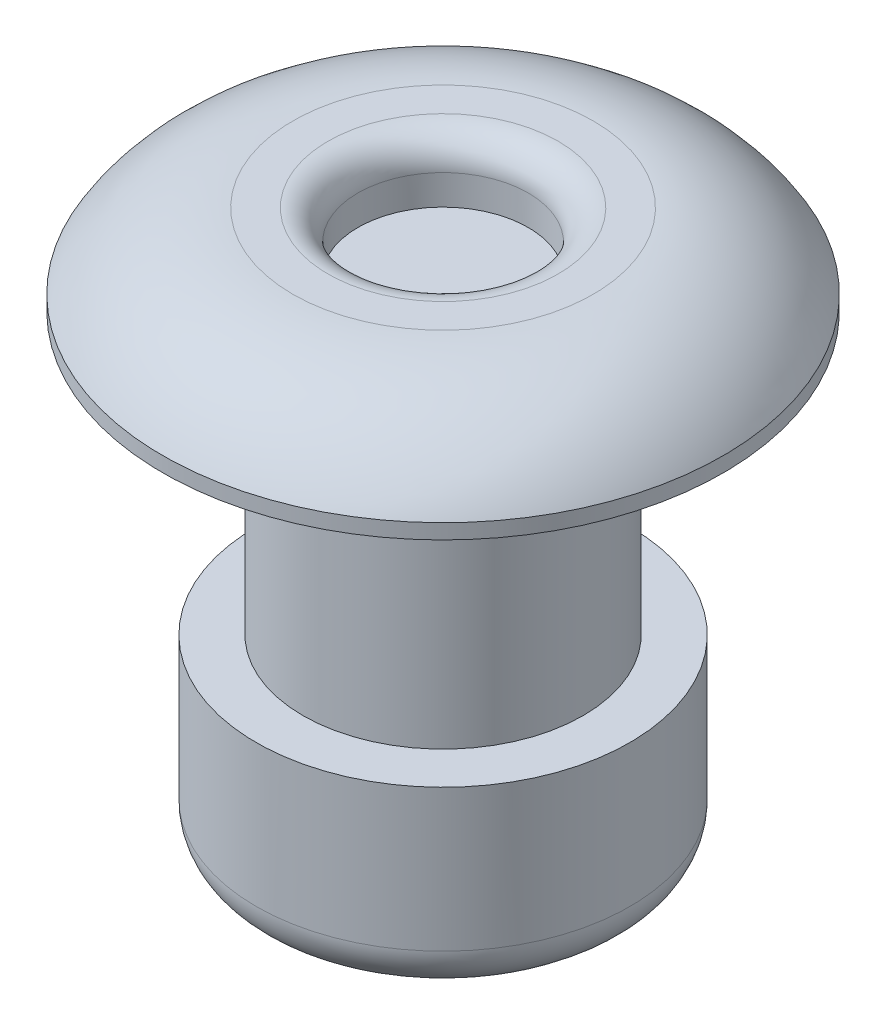
ISO-10303-21;
HEADER;
FILE_DESCRIPTION(('STEP AP214'),'2;1');
FILE_NAME('part.step','',(''),(''),'','','');
FILE_SCHEMA(('AUTOMOTIVE_DESIGN { 1 0 10303 214 1 1 1 1 }'));
ENDSEC;
DATA;
#1=APPLICATION_CONTEXT('core data for automotive mechanical design processes');
#2=APPLICATION_PROTOCOL_DEFINITION('international standard','automotive_design',2000,#1);
#3=PRODUCT_CONTEXT('',#1,'mechanical');
#4=PRODUCT('Part','Part','',(#3));
#5=PRODUCT_RELATED_PRODUCT_CATEGORY('part','',(#4));
#6=PRODUCT_DEFINITION_FORMATION('','',#4);
#7=PRODUCT_DEFINITION_CONTEXT('part definition',#1,'design');
#8=PRODUCT_DEFINITION('design','',#6,#7);
#9=PRODUCT_DEFINITION_SHAPE('','',#8);
#10=(LENGTH_UNIT() NAMED_UNIT(*) SI_UNIT(.MILLI.,.METRE.));
#11=(NAMED_UNIT(*) PLANE_ANGLE_UNIT() SI_UNIT($,.RADIAN.));
#12=(NAMED_UNIT(*) SI_UNIT($,.STERADIAN.) SOLID_ANGLE_UNIT());
#13=UNCERTAINTY_MEASURE_WITH_UNIT(LENGTH_MEASURE(1.E-05),#10,'distance_accuracy_value','');
#14=(GEOMETRIC_REPRESENTATION_CONTEXT(3) GLOBAL_UNCERTAINTY_ASSIGNED_CONTEXT((#13)) GLOBAL_UNIT_ASSIGNED_CONTEXT((#10,
#11,#12)) REPRESENTATION_CONTEXT('',''));
#15=CARTESIAN_POINT('',(0.,0.,0.));
#16=DIRECTION('',(0.,0.,1.));
#17=DIRECTION('',(1.,0.,0.));
#18=AXIS2_PLACEMENT_3D('',#15,#16,#17);
#19=CARTESIAN_POINT('',(0.,1.524,0.));
#20=DIRECTION('',(0.,-1.,0.));
#21=DIRECTION('',(0.,0.,-1.));
#22=AXIS2_PLACEMENT_3D('',#19,#20,#21);
#23=PLANE('',#22);
#24=CARTESIAN_POINT('',(0.,1.524,0.));
#25=DIRECTION('',(0.,-1.,0.));
#26=DIRECTION('',(0.,0.,-1.));
#27=AXIS2_PLACEMENT_3D('',#24,#25,#26);
#28=CIRCLE('',#27,1.9558);
#29=CARTESIAN_POINT('',(0.,1.524,-1.9558));
#30=VERTEX_POINT('',#29);
#31=EDGE_CURVE('E52',#30,#30,#28,.T.);
#32=ORIENTED_EDGE('',*,*,#31,.T.);
#33=EDGE_LOOP('',(#32));
#34=FACE_BOUND('',#33,.T.);
#35=CARTESIAN_POINT('',(0.,1.524,0.));
#36=DIRECTION('',(0.,-1.,0.));
#37=DIRECTION('',(0.,0.,-1.));
#38=AXIS2_PLACEMENT_3D('',#35,#36,#37);
#39=CIRCLE('',#38,2.5527);
#40=CARTESIAN_POINT('',(0.,1.524,-2.5527));
#41=VERTEX_POINT('',#40);
#42=EDGE_CURVE('E60',#41,#41,#39,.T.);
#43=ORIENTED_EDGE('',*,*,#42,.F.);
#44=EDGE_LOOP('',(#43));
#45=FACE_BOUND('',#44,.T.);
#46=ADVANCED_FACE('F37',(#34,#45),#23,.F.);
#47=CARTESIAN_POINT('',(0.,-1.033526,0.));
#48=DIRECTION('',(0.,-1.,0.));
#49=DIRECTION('',(0.,0.,-1.));
#50=AXIS2_PLACEMENT_3D('',#47,#48,#49);
#51=DEGENERATE_TOROIDAL_SURFACE('',#50,2.5527,2.557526,.T.);
#52=CARTESIAN_POINT('',(0.,0.253999999999999,0.));
#53=DIRECTION('',(0.,-1.,0.));
#54=DIRECTION('',(0.,0.,-1.));
#55=AXIS2_PLACEMENT_3D('',#52,#53,#54);
#56=CIRCLE('',#55,4.7625);
#57=CARTESIAN_POINT('',(0.,0.253999999999999,-4.7625));
#58=VERTEX_POINT('',#57);
#59=EDGE_CURVE('E63',#58,#58,#56,.T.);
#60=ORIENTED_EDGE('',*,*,#59,.F.);
#61=EDGE_LOOP('',(#60));
#62=FACE_BOUND('',#61,.T.);
#63=ORIENTED_EDGE('',*,*,#42,.T.);
#64=EDGE_LOOP('',(#63));
#65=FACE_BOUND('',#64,.T.);
#66=ADVANCED_FACE('F103',(#62,#65),#51,.T.);
#67=CARTESIAN_POINT('',(0.,-4.15541832528664,0.));
#68=DIRECTION('',(0.,-1.,0.));
#69=DIRECTION('',(0.,0.,-1.));
#70=AXIS2_PLACEMENT_3D('',#67,#68,#69);
#71=CYLINDRICAL_SURFACE('',#70,4.7625);
#72=CARTESIAN_POINT('',(0.,0.,0.));
#73=DIRECTION('',(0.,-1.,0.));
#74=DIRECTION('',(0.,0.,-1.));
#75=AXIS2_PLACEMENT_3D('',#72,#73,#74);
#76=CIRCLE('',#75,4.7625);
#77=CARTESIAN_POINT('',(0.,0.,-4.7625));
#78=VERTEX_POINT('',#77);
#79=EDGE_CURVE('E66',#78,#78,#76,.T.);
#80=ORIENTED_EDGE('',*,*,#79,.F.);
#81=EDGE_LOOP('',(#80));
#82=FACE_BOUND('',#81,.T.);
#83=ORIENTED_EDGE('',*,*,#59,.T.);
#84=EDGE_LOOP('',(#83));
#85=FACE_BOUND('',#84,.T.);
#86=ADVANCED_FACE('F109',(#82,#85),#71,.T.);
#87=CARTESIAN_POINT('',(0.,0.,0.));
#88=DIRECTION('',(0.,1.,0.));
#89=DIRECTION('',(0.,0.,1.));
#90=AXIS2_PLACEMENT_3D('',#87,#88,#89);
#91=PLANE('',#90);
#92=CARTESIAN_POINT('',(0.,0.,0.));
#93=DIRECTION('',(0.,-1.,0.));
#94=DIRECTION('',(0.,0.,-1.));
#95=AXIS2_PLACEMENT_3D('',#92,#93,#94);
#96=CIRCLE('',#95,2.38125);
#97=CARTESIAN_POINT('',(0.,0.,-2.38125));
#98=VERTEX_POINT('',#97);
#99=EDGE_CURVE('E48',#98,#98,#96,.T.);
#100=ORIENTED_EDGE('',*,*,#99,.F.);
#101=EDGE_LOOP('',(#100));
#102=FACE_BOUND('',#101,.T.);
#103=ORIENTED_EDGE('',*,*,#79,.T.);
#104=EDGE_LOOP('',(#103));
#105=FACE_BOUND('',#104,.T.);
#106=ADVANCED_FACE('F134',(#102,#105),#91,.F.);
#107=CARTESIAN_POINT('',(0.,0.508,0.));
#108=DIRECTION('',(0.,1.,0.));
#109=DIRECTION('',(0.,0.,1.));
#110=AXIS2_PLACEMENT_3D('',#107,#108,#109);
#111=CYLINDRICAL_SURFACE('',#110,1.4478);
#112=CARTESIAN_POINT('',(0.,1.016,0.));
#113=DIRECTION('',(0.,-1.,0.));
#114=DIRECTION('',(0.,0.,-1.));
#115=AXIS2_PLACEMENT_3D('',#112,#113,#114);
#116=CIRCLE('',#115,1.4478);
#117=CARTESIAN_POINT('',(0.,1.016,-1.4478));
#118=VERTEX_POINT('',#117);
#119=EDGE_CURVE('E57',#118,#118,#116,.F.);
#120=ORIENTED_EDGE('',*,*,#119,.T.);
#121=EDGE_LOOP('',(#120));
#122=FACE_BOUND('',#121,.T.);
#123=CARTESIAN_POINT('',(0.,0.508,0.));
#124=DIRECTION('',(0.,1.,0.));
#125=DIRECTION('',(0.,0.,1.));
#126=AXIS2_PLACEMENT_3D('',#123,#124,#125);
#127=CIRCLE('',#126,1.4478);
#128=CARTESIAN_POINT('',(0.,0.508,1.4478));
#129=VERTEX_POINT('',#128);
#130=EDGE_CURVE('E69',#129,#129,#127,.T.);
#131=ORIENTED_EDGE('',*,*,#130,.F.);
#132=EDGE_LOOP('',(#131));
#133=FACE_BOUND('',#132,.T.);
#134=ADVANCED_FACE('F125',(#122,#133),#111,.F.);
#135=CARTESIAN_POINT('',(0.,0.508,0.));
#136=DIRECTION('',(0.,1.,0.));
#137=DIRECTION('',(0.,0.,1.));
#138=AXIS2_PLACEMENT_3D('',#135,#136,#137);
#139=PLANE('',#138);
#140=ORIENTED_EDGE('',*,*,#130,.T.);
#141=EDGE_LOOP('',(#140));
#142=FACE_BOUND('',#141,.T.);
#143=ADVANCED_FACE('F117',(#142),#139,.T.);
#144=CARTESIAN_POINT('',(0.,1.016,0.));
#145=DIRECTION('',(0.,-1.,0.));
#146=DIRECTION('',(0.,0.,-1.));
#147=AXIS2_PLACEMENT_3D('',#144,#145,#146);
#148=TOROIDAL_SURFACE('',#147,1.9558,0.508);
#149=ORIENTED_EDGE('',*,*,#31,.F.);
#150=EDGE_LOOP('',(#149));
#151=FACE_BOUND('',#150,.T.);
#152=ORIENTED_EDGE('',*,*,#119,.F.);
#153=EDGE_LOOP('',(#152));
#154=FACE_BOUND('',#153,.T.);
#155=ADVANCED_FACE('F114',(#151,#154),#148,.T.);
#156=CARTESIAN_POINT('',(0.,0.,0.));
#157=DIRECTION('',(0.,-1.,0.));
#158=DIRECTION('',(0.,0.,-1.));
#159=AXIS2_PLACEMENT_3D('',#156,#157,#158);
#160=CYLINDRICAL_SURFACE('',#159,2.38125);
#161=CARTESIAN_POINT('',(0.,-4.7625,0.));
#162=DIRECTION('',(0.,-1.,0.));
#163=DIRECTION('',(0.,0.,-1.));
#164=AXIS2_PLACEMENT_3D('',#161,#162,#163);
#165=CIRCLE('',#164,2.38125);
#166=CARTESIAN_POINT('',(0.,-4.7625,-2.38125));
#167=VERTEX_POINT('',#166);
#168=EDGE_CURVE('E71',#167,#167,#165,.T.);
#169=ORIENTED_EDGE('',*,*,#168,.F.);
#170=EDGE_LOOP('',(#169));
#171=FACE_BOUND('',#170,.T.);
#172=ORIENTED_EDGE('',*,*,#99,.T.);
#173=EDGE_LOOP('',(#172));
#174=FACE_BOUND('',#173,.T.);
#175=ADVANCED_FACE('F116',(#171,#174),#160,.T.);
#176=CARTESIAN_POINT('',(-2.38125,-4.7625,0.));
#177=DIRECTION('',(0.,-1.,0.));
#178=DIRECTION('',(0.,0.,-1.));
#179=AXIS2_PLACEMENT_3D('',#176,#177,#178);
#180=PLANE('',#179);
#181=CARTESIAN_POINT('',(0.,-4.7625,0.));
#182=DIRECTION('',(0.,-1.,0.));
#183=DIRECTION('',(0.,0.,-1.));
#184=AXIS2_PLACEMENT_3D('',#181,#182,#183);
#185=CIRCLE('',#184,3.175);
#186=CARTESIAN_POINT('',(0.,-4.7625,-3.175));
#187=VERTEX_POINT('',#186);
#188=EDGE_CURVE('E75',#187,#187,#185,.T.);
#189=ORIENTED_EDGE('',*,*,#188,.F.);
#190=EDGE_LOOP('',(#189));
#191=FACE_BOUND('',#190,.T.);
#192=ORIENTED_EDGE('',*,*,#168,.T.);
#193=EDGE_LOOP('',(#192));
#194=FACE_BOUND('',#193,.T.);
#195=ADVANCED_FACE('F100',(#191,#194),#180,.F.);
#196=CARTESIAN_POINT('',(0.,0.,0.));
#197=DIRECTION('',(0.,-1.,0.));
#198=DIRECTION('',(0.,0.,-1.));
#199=AXIS2_PLACEMENT_3D('',#196,#197,#198);
#200=CYLINDRICAL_SURFACE('',#199,3.175);
#201=CARTESIAN_POINT('',(0.,-7.1755,0.));
#202=DIRECTION('',(0.,1.,0.));
#203=DIRECTION('',(0.,0.,1.));
#204=AXIS2_PLACEMENT_3D('',#201,#202,#203);
#205=CIRCLE('',#204,3.175);
#206=CARTESIAN_POINT('',(0.,-7.1755,3.175));
#207=VERTEX_POINT('',#206);
#208=EDGE_CURVE('E10',#207,#207,#205,.T.);
#209=ORIENTED_EDGE('',*,*,#208,.T.);
#210=EDGE_LOOP('',(#209));
#211=FACE_BOUND('',#210,.T.);
#212=ORIENTED_EDGE('',*,*,#188,.T.);
#213=EDGE_LOOP('',(#212));
#214=FACE_BOUND('',#213,.T.);
#215=ADVANCED_FACE('F95',(#211,#214),#200,.T.);
#216=CARTESIAN_POINT('',(-3.175,-7.9375,0.));
#217=DIRECTION('',(0.,1.,0.));
#218=DIRECTION('',(0.,0.,1.));
#219=AXIS2_PLACEMENT_3D('',#216,#217,#218);
#220=PLANE('',#219);
#221=CARTESIAN_POINT('',(0.,-7.9375,0.));
#222=DIRECTION('',(0.,1.,0.));
#223=DIRECTION('',(0.,0.,1.));
#224=AXIS2_PLACEMENT_3D('',#221,#222,#223);
#225=CIRCLE('',#224,2.413);
#226=CARTESIAN_POINT('',(0.,-7.9375,2.413));
#227=VERTEX_POINT('',#226);
#228=EDGE_CURVE('E44',#227,#227,#225,.F.);
#229=ORIENTED_EDGE('',*,*,#228,.T.);
#230=EDGE_LOOP('',(#229));
#231=FACE_BOUND('',#230,.T.);
#232=CARTESIAN_POINT('',(0.,-7.9375,0.));
#233=DIRECTION('',(0.,-1.,0.));
#234=DIRECTION('',(0.,0.,-1.));
#235=AXIS2_PLACEMENT_3D('',#232,#233,#234);
#236=CIRCLE('',#235,1.4478);
#237=CARTESIAN_POINT('',(0.,-7.9375,-1.4478));
#238=VERTEX_POINT('',#237);
#239=EDGE_CURVE('E78',#238,#238,#236,.T.);
#240=ORIENTED_EDGE('',*,*,#239,.F.);
#241=EDGE_LOOP('',(#240));
#242=FACE_BOUND('',#241,.T.);
#243=ADVANCED_FACE('F90',(#231,#242),#220,.F.);
#244=CARTESIAN_POINT('',(0.,0.,0.));
#245=DIRECTION('',(0.,-1.,0.));
#246=DIRECTION('',(0.,0.,-1.));
#247=AXIS2_PLACEMENT_3D('',#244,#245,#246);
#248=CYLINDRICAL_SURFACE('',#247,1.4478);
#249=CARTESIAN_POINT('',(0.,-5.3975,0.));
#250=DIRECTION('',(0.,-1.,0.));
#251=DIRECTION('',(0.,0.,-1.));
#252=AXIS2_PLACEMENT_3D('',#249,#250,#251);
#253=CIRCLE('',#252,1.4478);
#254=CARTESIAN_POINT('',(0.,-5.3975,-1.4478));
#255=VERTEX_POINT('',#254);
#256=EDGE_CURVE('E81',#255,#255,#253,.T.);
#257=ORIENTED_EDGE('',*,*,#256,.F.);
#258=EDGE_LOOP('',(#257));
#259=FACE_BOUND('',#258,.T.);
#260=ORIENTED_EDGE('',*,*,#239,.T.);
#261=EDGE_LOOP('',(#260));
#262=FACE_BOUND('',#261,.T.);
#263=ADVANCED_FACE('F87',(#259,#262),#248,.F.);
#264=CARTESIAN_POINT('',(-1.4478,-5.3975,0.));
#265=DIRECTION('',(0.,1.,0.));
#266=DIRECTION('',(0.,0.,1.));
#267=AXIS2_PLACEMENT_3D('',#264,#265,#266);
#268=PLANE('',#267);
#269=ORIENTED_EDGE('',*,*,#256,.T.);
#270=EDGE_LOOP('',(#269));
#271=FACE_BOUND('',#270,.T.);
#272=ADVANCED_FACE('F85',(#271),#268,.F.);
#273=CARTESIAN_POINT('',(0.,-7.1755,0.));
#274=DIRECTION('',(0.,1.,0.));
#275=DIRECTION('',(0.,0.,1.));
#276=AXIS2_PLACEMENT_3D('',#273,#274,#275);
#277=TOROIDAL_SURFACE('',#276,2.413,0.762);
#278=ORIENTED_EDGE('',*,*,#208,.F.);
#279=EDGE_LOOP('',(#278));
#280=FACE_BOUND('',#279,.T.);
#281=ORIENTED_EDGE('',*,*,#228,.F.);
#282=EDGE_LOOP('',(#281));
#283=FACE_BOUND('',#282,.T.);
#284=ADVANCED_FACE('F39',(#280,#283),#277,.T.);
#285=CLOSED_SHELL('',(#46,#66,#86,#106,#134,#143,#155,#175,#195,#215,#243,#263,#272,#284));
#286=MANIFOLD_SOLID_BREP('B2',#285);
#287=ADVANCED_BREP_SHAPE_REPRESENTATION('',(#18,#286),#14);
#288=SHAPE_DEFINITION_REPRESENTATION(#9,#287);
ENDSEC;
END-ISO-10303-21;
